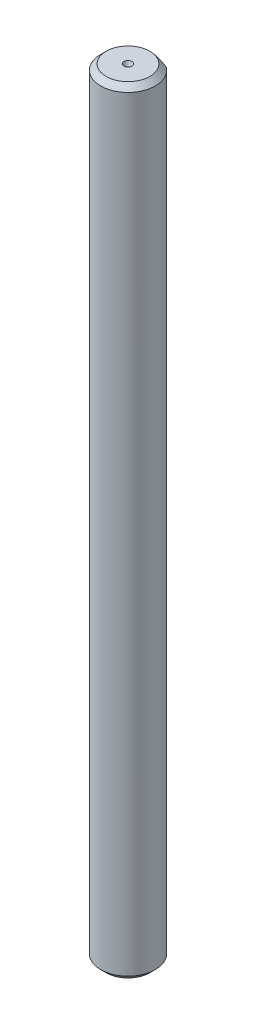
ISO-10303-21;
HEADER;
FILE_DESCRIPTION(('STEP AP214'),'2;1');
FILE_NAME('part.step','',(''),(''),'','','');
FILE_SCHEMA(('AUTOMOTIVE_DESIGN { 1 0 10303 214 1 1 1 1 }'));
ENDSEC;
DATA;
#1=APPLICATION_CONTEXT('core data for automotive mechanical design processes');
#2=APPLICATION_PROTOCOL_DEFINITION('international standard','automotive_design',2000,#1);
#3=PRODUCT_CONTEXT('',#1,'mechanical');
#4=PRODUCT('Part','Part','',(#3));
#5=PRODUCT_RELATED_PRODUCT_CATEGORY('part','',(#4));
#6=PRODUCT_DEFINITION_FORMATION('','',#4);
#7=PRODUCT_DEFINITION_CONTEXT('part definition',#1,'design');
#8=PRODUCT_DEFINITION('design','',#6,#7);
#9=PRODUCT_DEFINITION_SHAPE('','',#8);
#10=(LENGTH_UNIT() NAMED_UNIT(*) SI_UNIT(.MILLI.,.METRE.));
#11=(NAMED_UNIT(*) PLANE_ANGLE_UNIT() SI_UNIT($,.RADIAN.));
#12=(NAMED_UNIT(*) SI_UNIT($,.STERADIAN.) SOLID_ANGLE_UNIT());
#13=UNCERTAINTY_MEASURE_WITH_UNIT(LENGTH_MEASURE(1.E-05),#10,'distance_accuracy_value','');
#14=(GEOMETRIC_REPRESENTATION_CONTEXT(3) GLOBAL_UNCERTAINTY_ASSIGNED_CONTEXT((#13)) GLOBAL_UNIT_ASSIGNED_CONTEXT((#10,
#11,#12)) REPRESENTATION_CONTEXT('',''));
#15=CARTESIAN_POINT('',(0.,0.,0.));
#16=DIRECTION('',(0.,0.,1.));
#17=DIRECTION('',(1.,0.,0.));
#18=AXIS2_PLACEMENT_3D('',#15,#16,#17);
#19=CARTESIAN_POINT('',(0.,71.,0.));
#20=DIRECTION('',(0.,-1.,0.));
#21=DIRECTION('',(0.,0.,-1.));
#22=AXIS2_PLACEMENT_3D('',#19,#20,#21);
#23=CYLINDRICAL_SURFACE('',#22,2.5);
#24=CARTESIAN_POINT('',(0.,70.5,0.));
#25=DIRECTION('',(0.,1.,0.));
#26=DIRECTION('',(0.,0.,1.));
#27=AXIS2_PLACEMENT_3D('',#24,#25,#26);
#28=CIRCLE('',#27,2.5);
#29=CARTESIAN_POINT('',(1.5,70.5,-2.));
#30=VERTEX_POINT('',#29);
#31=CARTESIAN_POINT('',(-1.5,70.5,-2.));
#32=VERTEX_POINT('',#31);
#33=EDGE_CURVE('E85',#30,#32,#28,.F.);
#34=ORIENTED_EDGE('',*,*,#33,.T.);
#35=DIRECTION('',(0.,1.,0.));
#36=VECTOR('',#35,1.);
#37=CARTESIAN_POINT('',(-1.5,56.,-2.));
#38=LINE('',#37,#36);
#39=CARTESIAN_POINT('',(-1.5,56.,-2.));
#40=VERTEX_POINT('',#39);
#41=EDGE_CURVE('E79',#40,#32,#38,.T.);
#42=ORIENTED_EDGE('',*,*,#41,.F.);
#43=CARTESIAN_POINT('',(0.,56.,0.));
#44=DIRECTION('',(0.,1.,0.));
#45=DIRECTION('',(0.,0.,1.));
#46=AXIS2_PLACEMENT_3D('',#43,#44,#45);
#47=CIRCLE('',#46,2.5);
#48=CARTESIAN_POINT('',(1.5,56.,-2.));
#49=VERTEX_POINT('',#48);
#50=EDGE_CURVE('E70',#49,#40,#47,.T.);
#51=ORIENTED_EDGE('',*,*,#50,.F.);
#52=DIRECTION('',(0.,1.,0.));
#53=VECTOR('',#52,1.);
#54=CARTESIAN_POINT('',(1.5,56.,-2.));
#55=LINE('',#54,#53);
#56=EDGE_CURVE('E80',#49,#30,#55,.T.);
#57=ORIENTED_EDGE('',*,*,#56,.T.);
#58=EDGE_LOOP('',(#34,#42,#51,#57));
#59=FACE_BOUND('',#58,.T.);
#60=CARTESIAN_POINT('',(0.,0.499999999999987,0.));
#61=DIRECTION('',(0.,1.,0.));
#62=DIRECTION('',(0.,0.,1.));
#63=AXIS2_PLACEMENT_3D('',#60,#61,#62);
#64=CIRCLE('',#63,2.5);
#65=CARTESIAN_POINT('',(0.,0.499999999999987,2.5));
#66=VERTEX_POINT('',#65);
#67=EDGE_CURVE('E93',#66,#66,#64,.T.);
#68=ORIENTED_EDGE('',*,*,#67,.T.);
#69=EDGE_LOOP('',(#68));
#70=FACE_BOUND('',#69,.T.);
#71=ADVANCED_FACE('F34',(#59,#70),#23,.T.);
#72=CARTESIAN_POINT('',(0.,71.,0.));
#73=DIRECTION('',(0.,1.,0.));
#74=DIRECTION('',(0.,0.,1.));
#75=AXIS2_PLACEMENT_3D('',#72,#73,#74);
#76=PLANE('',#75);
#77=CARTESIAN_POINT('',(0.,71.,0.));
#78=DIRECTION('',(0.,1.,0.));
#79=DIRECTION('',(0.,0.,1.));
#80=AXIS2_PLACEMENT_3D('',#77,#78,#79);
#81=CIRCLE('',#80,0.368933834947047);
#82=CARTESIAN_POINT('',(0.,71.,0.368933834947047));
#83=VERTEX_POINT('',#82);
#84=EDGE_CURVE('E87',#83,#83,#81,.T.);
#85=ORIENTED_EDGE('',*,*,#84,.F.);
#86=EDGE_LOOP('',(#85));
#87=FACE_BOUND('',#86,.T.);
#88=CARTESIAN_POINT('',(0.,71.,0.));
#89=DIRECTION('',(0.,1.,0.));
#90=DIRECTION('',(0.,0.,1.));
#91=AXIS2_PLACEMENT_3D('',#88,#89,#90);
#92=CIRCLE('',#91,2.);
#93=CARTESIAN_POINT('',(0.,71.,-2.));
#94=VERTEX_POINT('',#93);
#95=EDGE_CURVE('E98',#94,#94,#92,.T.);
#96=ORIENTED_EDGE('',*,*,#95,.T.);
#97=EDGE_LOOP('',(#96));
#98=FACE_BOUND('',#97,.T.);
#99=ADVANCED_FACE('F114',(#87,#98),#76,.T.);
#100=CARTESIAN_POINT('',(0.,0.,0.));
#101=DIRECTION('',(0.,1.,0.));
#102=DIRECTION('',(0.,0.,1.));
#103=AXIS2_PLACEMENT_3D('',#100,#101,#102);
#104=PLANE('',#103);
#105=CARTESIAN_POINT('',(0.,0.,0.));
#106=DIRECTION('',(0.,1.,0.));
#107=DIRECTION('',(0.,0.,1.));
#108=AXIS2_PLACEMENT_3D('',#105,#106,#107);
#109=CIRCLE('',#108,2.00000000000001);
#110=CARTESIAN_POINT('',(0.,0.,2.00000000000001));
#111=VERTEX_POINT('',#110);
#112=EDGE_CURVE('E96',#111,#111,#109,.F.);
#113=ORIENTED_EDGE('',*,*,#112,.T.);
#114=EDGE_LOOP('',(#113));
#115=FACE_BOUND('',#114,.T.);
#116=ADVANCED_FACE('F111',(#115),#104,.F.);
#117=CARTESIAN_POINT('',(0.,0.499999999999987,0.));
#118=DIRECTION('',(0.,1.,0.));
#119=DIRECTION('',(0.,0.,1.));
#120=AXIS2_PLACEMENT_3D('',#117,#118,#119);
#121=CONICAL_SURFACE('',#120,2.5,0.785398163397453);
#122=ORIENTED_EDGE('',*,*,#112,.F.);
#123=EDGE_LOOP('',(#122));
#124=FACE_BOUND('',#123,.T.);
#125=ORIENTED_EDGE('',*,*,#67,.F.);
#126=EDGE_LOOP('',(#125));
#127=FACE_BOUND('',#126,.T.);
#128=ADVANCED_FACE('F105',(#124,#127),#121,.T.);
#129=CARTESIAN_POINT('',(0.,71.,0.));
#130=DIRECTION('',(0.,-1.,0.));
#131=DIRECTION('',(0.,0.,-1.));
#132=AXIS2_PLACEMENT_3D('',#129,#130,#131);
#133=CONICAL_SURFACE('',#132,2.,0.785398163397446);
#134=CARTESIAN_POINT('',(-3.05046237304907,69.3523540893628,-2.));
#135=CARTESIAN_POINT('',(-2.97819280230489,69.4127795768134,-2.));
#136=CARTESIAN_POINT('',(-2.90561482282155,69.4728409726599,-2.));
#137=CARTESIAN_POINT('',(-2.75969297896042,69.5920517840241,-2.));
#138=CARTESIAN_POINT('',(-2.68634898156782,69.6512010365838,-2.));
#139=CARTESIAN_POINT('',(-2.53824127010594,69.7688032751404,-2.));
#140=CARTESIAN_POINT('',(-2.46347114157042,69.8272482043826,-2.));
#141=CARTESIAN_POINT('',(-2.31285154645429,69.9427230300633,-2.));
#142=CARTESIAN_POINT('',(-2.2370021522091,69.9997530206387,-2.));
#143=CARTESIAN_POINT('',(-2.07682509237634,70.1172986547914,-2.));
#144=CARTESIAN_POINT('',(-1.9923690144222,70.1776401136847,-2.));
#145=CARTESIAN_POINT('',(-1.82153234384277,70.2955304544415,-2.));
#146=CARTESIAN_POINT('',(-1.73515197512684,70.3530796587592,-2.));
#147=CARTESIAN_POINT('',(-1.56024154108809,70.4642937472491,-2.));
#148=CARTESIAN_POINT('',(-1.47171804140618,70.5179688790696,-2.));
#149=CARTESIAN_POINT('',(-1.29180406288052,70.6202357304425,-2.));
#150=CARTESIAN_POINT('',(-1.20041520429801,70.6688302578395,-2.));
#151=CARTESIAN_POINT('',(-1.030116488509,70.7513144320976,-2.));
#152=CARTESIAN_POINT('',(-0.951741952724334,70.786297973025,-2.));
#153=CARTESIAN_POINT('',(-0.79242093010037,70.8499760783841,-2.));
#154=CARTESIAN_POINT('',(-0.711474142155232,70.8786699034184,-2.));
#155=CARTESIAN_POINT('',(-0.548849154664487,70.9274760575201,-2.));
#156=CARTESIAN_POINT('',(-0.467222590868758,70.9477569737081,-2.));
#157=CARTESIAN_POINT('',(-0.302191824156156,70.978915332396,-2.));
#158=CARTESIAN_POINT('',(-0.218788938845118,70.9897995120803,-2.));
#159=CARTESIAN_POINT('',(-0.0726414802662715,70.9996534169534,-2.));
#160=CARTESIAN_POINT('',(-0.0100481773359509,71.0009523808962,-2.));
#161=CARTESIAN_POINT('',(0.114978890107864,70.9976715491136,-2.));
#162=CARTESIAN_POINT('',(0.177412672952461,70.9930924623945,-2.));
#163=CARTESIAN_POINT('',(0.301925112508527,70.9782893415559,-2.));
#164=CARTESIAN_POINT('',(0.364000234355802,70.9680360775351,-2.));
#165=CARTESIAN_POINT('',(0.487083671249213,70.9424231399316,-2.));
#166=CARTESIAN_POINT('',(0.548091725407746,70.9270622354544,-2.));
#167=CARTESIAN_POINT('',(0.701442839011809,70.8824293459371,-2.));
#168=CARTESIAN_POINT('',(0.79290189489099,70.8501257786996,-2.));
#169=CARTESIAN_POINT('',(0.972597599225778,70.77757637924,-2.));
#170=CARTESIAN_POINT('',(1.06083171657374,70.7373244608871,-2.));
#171=CARTESIAN_POINT('',(1.23534467028215,70.6504715899035,-2.));
#172=CARTESIAN_POINT('',(1.32158961030164,70.6038032989955,-2.));
#173=CARTESIAN_POINT('',(1.44900594293518,70.5305025175874,-2.));
#174=CARTESIAN_POINT('',(1.49114622438879,70.5055235009586,-2.));
#175=CARTESIAN_POINT('',(1.57484169622225,70.4546072618461,-2.));
#176=CARTESIAN_POINT('',(1.6163969172825,70.4286700898682,-2.));
#177=CARTESIAN_POINT('',(1.7634943431341,70.334807350793,-2.));
#178=CARTESIAN_POINT('',(1.86757579691446,70.2645905210021,-2.));
#179=CARTESIAN_POINT('',(2.0730838154575,70.1203584388146,-2.));
#180=CARTESIAN_POINT('',(2.17450959092299,70.0463420760785,-2.));
#181=CARTESIAN_POINT('',(2.37537283025658,69.8954874039309,-2.));
#182=CARTESIAN_POINT('',(2.47480845930885,69.8186466603806,-2.));
#183=CARTESIAN_POINT('',(2.67205501779372,69.6629023233612,-2.));
#184=CARTESIAN_POINT('',(2.76986583280206,69.5839985856085,-2.));
#185=CARTESIAN_POINT('',(2.96457124651359,69.4243085881951,-2.));
#186=CARTESIAN_POINT('',(3.06146081511226,69.3435162101495,-2.));
#187=CARTESIAN_POINT('',(3.25419299320949,69.1806906528786,-2.));
#188=CARTESIAN_POINT('',(3.3500355792903,69.0986574459974,-2.));
#189=CARTESIAN_POINT('',(3.63619070660152,68.8511868996503,-2.));
#190=CARTESIAN_POINT('',(3.82523909459796,68.6842886305257,-2.));
#191=CARTESIAN_POINT('',(4.17809082313825,68.3684677439524,-2.));
#192=CARTESIAN_POINT('',(4.34215822007578,68.219838436103,-2.));
#193=CARTESIAN_POINT('',(4.66899589250916,67.9211099646972,-2.));
#194=CARTESIAN_POINT('',(4.83176596083719,67.7710105745903,-2.));
#195=CARTESIAN_POINT('',(5.15506503563188,67.4708858166161,-2.));
#196=CARTESIAN_POINT('',(5.31560166313852,67.3208686430965,-2.));
#197=CARTESIAN_POINT('',(5.63586427489201,67.0200316423801,-2.));
#198=CARTESIAN_POINT('',(5.79559040677761,66.8692119724288,-2.));
#199=CARTESIAN_POINT('',(5.9550293776425,66.7180914613005,-2.));
#200=B_SPLINE_CURVE_WITH_KNOTS('',3,(#134,#135,#136,#137,#138,#139,#140,#141,#142,#143,#144,
#145,#146,#147,#148,#149,#150,#151,#152,#153,#154,#155,#156,#157,#158,#159,#160,#161,#162,#163,
#164,#165,#166,#167,#168,#169,#170,#171,#172,#173,#174,#175,#176,#177,#178,#179,#180,#181,#182,
#183,#184,#185,#186,#187,#188,#189,#190,#191,#192,#193,#194,#195,#196,#197,#198,#199),
.UNSPECIFIED.,.F.,.F.,(4,2,2,2,2,2,2,2,2,2,2,2,2,2,2,2,2,2,2,2,2,2,2,2,2,2,2,2,2,2,2,2,4),(0.,
0.282611147338683,0.565272212613808,0.849964297298593,1.1346373901656,1.44598770084532,
1.75730197028675,2.06776003965402,2.37804561420926,2.63532314556343,2.89263090538034,
3.1444992645464,3.39618689116324,3.58374175238014,3.77127399298788,3.95978140102543,
4.14833427059229,4.43878724943566,4.72946349947765,5.02346365278068,5.17041625961875,
5.31736113138892,5.69387889032201,6.07050731268035,6.4474683076896,6.82445573782934,
7.20290648721733,7.5813656841177,8.33786130824478,9.00199051543549,9.66622373268931,
10.325382616298,10.9844167767548),.UNSPECIFIED.);
#201=EDGE_CURVE('E11',#32,#94,#200,.T.);
#202=ORIENTED_EDGE('',*,*,#201,.F.);
#203=ORIENTED_EDGE('',*,*,#33,.F.);
#204=EDGE_CURVE('E39',#94,#30,#200,.T.);
#205=ORIENTED_EDGE('',*,*,#204,.F.);
#206=ORIENTED_EDGE('',*,*,#95,.F.);
#207=EDGE_LOOP('',(#202,#203,#205,#206));
#208=FACE_BOUND('',#207,.T.);
#209=ADVANCED_FACE('F36',(#208),#133,.T.);
#210=CARTESIAN_POINT('',(0.,71.,0.));
#211=DIRECTION('',(0.,1.,0.));
#212=DIRECTION('',(0.,0.,1.));
#213=AXIS2_PLACEMENT_3D('',#210,#211,#212);
#214=CONICAL_SURFACE('',#213,0.368933834947047,0.383972435438753);
#215=CARTESIAN_POINT('',(0.,70.0868567153421,0.));
#216=VERTEX_POINT('',#215);
#217=VERTEX_LOOP('',#216);
#218=FACE_BOUND('',#217,.T.);
#219=ORIENTED_EDGE('',*,*,#84,.T.);
#220=EDGE_LOOP('',(#219));
#221=FACE_BOUND('',#220,.T.);
#222=ADVANCED_FACE('F104',(#218,#221),#214,.F.);
#223=CARTESIAN_POINT('',(-1.5,56.,-2.));
#224=DIRECTION('',(0.,0.,1.));
#225=DIRECTION('',(1.,0.,0.));
#226=AXIS2_PLACEMENT_3D('',#223,#224,#225);
#227=PLANE('',#226);
#228=ORIENTED_EDGE('',*,*,#201,.T.);
#229=ORIENTED_EDGE('',*,*,#204,.T.);
#230=ORIENTED_EDGE('',*,*,#56,.F.);
#231=DIRECTION('',(1.,0.,0.));
#232=VECTOR('',#231,1.);
#233=CARTESIAN_POINT('',(-1.5,56.,-2.));
#234=LINE('',#233,#232);
#235=EDGE_CURVE('E73',#40,#49,#234,.T.);
#236=ORIENTED_EDGE('',*,*,#235,.F.);
#237=ORIENTED_EDGE('',*,*,#41,.T.);
#238=EDGE_LOOP('',(#228,#229,#230,#236,#237));
#239=FACE_BOUND('',#238,.T.);
#240=ADVANCED_FACE('F78',(#239),#227,.F.);
#241=CARTESIAN_POINT('',(0.,56.,0.));
#242=DIRECTION('',(0.,1.,0.));
#243=DIRECTION('',(0.,0.,1.));
#244=AXIS2_PLACEMENT_3D('',#241,#242,#243);
#245=PLANE('',#244);
#246=ORIENTED_EDGE('',*,*,#50,.T.);
#247=ORIENTED_EDGE('',*,*,#235,.T.);
#248=EDGE_LOOP('',(#246,#247));
#249=FACE_BOUND('',#248,.T.);
#250=ADVANCED_FACE('F72',(#249),#245,.T.);
#251=CLOSED_SHELL('',(#71,#99,#116,#128,#209,#222,#240,#250));
#252=MANIFOLD_SOLID_BREP('B2',#251);
#253=ADVANCED_BREP_SHAPE_REPRESENTATION('',(#18,#252),#14);
#254=SHAPE_DEFINITION_REPRESENTATION(#9,#253);
ENDSEC;
END-ISO-10303-21;
